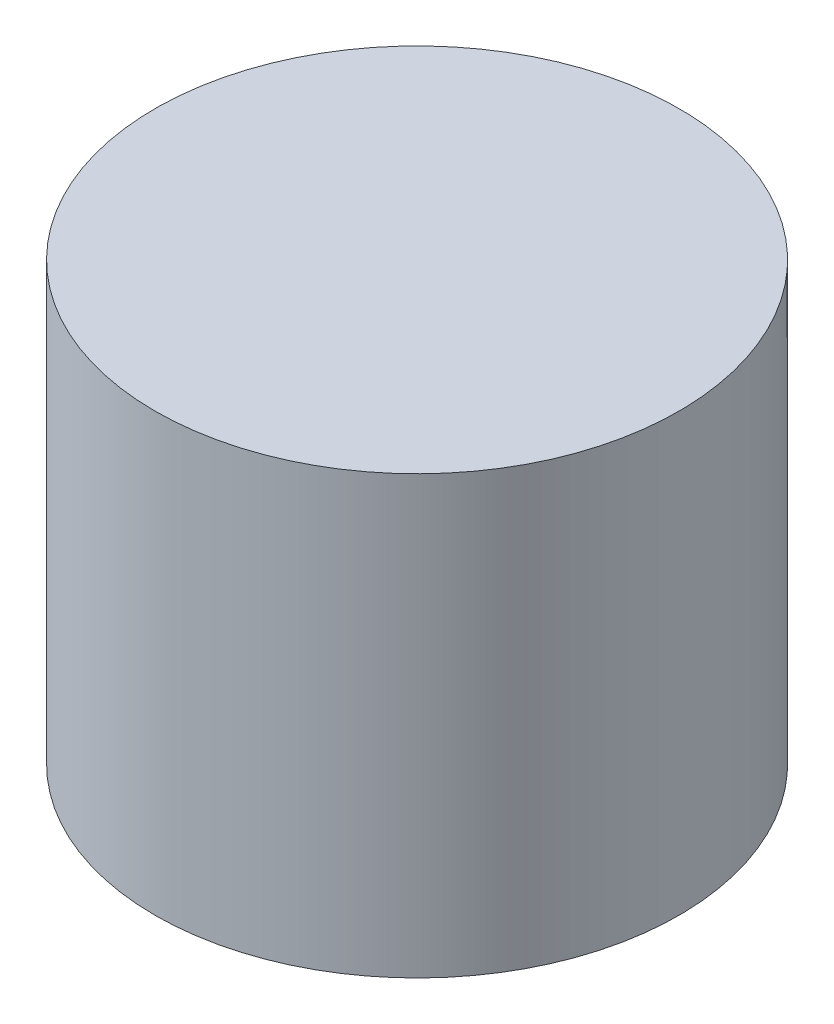
ISO-10303-21;
HEADER;
FILE_DESCRIPTION(('STEP AP214'),'2;1');
FILE_NAME('part.step','',(''),(''),'','','');
FILE_SCHEMA(('AUTOMOTIVE_DESIGN { 1 0 10303 214 1 1 1 1 }'));
ENDSEC;
DATA;
#1=APPLICATION_CONTEXT('core data for automotive mechanical design processes');
#2=APPLICATION_PROTOCOL_DEFINITION('international standard','automotive_design',2000,#1);
#3=PRODUCT_CONTEXT('',#1,'mechanical');
#4=PRODUCT('Part','Part','',(#3));
#5=PRODUCT_RELATED_PRODUCT_CATEGORY('part','',(#4));
#6=PRODUCT_DEFINITION_FORMATION('','',#4);
#7=PRODUCT_DEFINITION_CONTEXT('part definition',#1,'design');
#8=PRODUCT_DEFINITION('design','',#6,#7);
#9=PRODUCT_DEFINITION_SHAPE('','',#8);
#10=(LENGTH_UNIT() NAMED_UNIT(*) SI_UNIT(.MILLI.,.METRE.));
#11=(NAMED_UNIT(*) PLANE_ANGLE_UNIT() SI_UNIT($,.RADIAN.));
#12=(NAMED_UNIT(*) SI_UNIT($,.STERADIAN.) SOLID_ANGLE_UNIT());
#13=UNCERTAINTY_MEASURE_WITH_UNIT(LENGTH_MEASURE(1.E-05),#10,'distance_accuracy_value','');
#14=(GEOMETRIC_REPRESENTATION_CONTEXT(3) GLOBAL_UNCERTAINTY_ASSIGNED_CONTEXT((#13)) GLOBAL_UNIT_ASSIGNED_CONTEXT((#10,
#11,#12)) REPRESENTATION_CONTEXT('',''));
#15=CARTESIAN_POINT('',(0.,0.,0.));
#16=DIRECTION('',(0.,0.,1.));
#17=DIRECTION('',(1.,0.,0.));
#18=AXIS2_PLACEMENT_3D('',#15,#16,#17);
#19=CARTESIAN_POINT('',(0.,0.,0.));
#20=DIRECTION('',(0.,1.,0.));
#21=DIRECTION('',(0.,0.,1.));
#22=AXIS2_PLACEMENT_3D('',#19,#20,#21);
#23=PLANE('',#22);
#24=CARTESIAN_POINT('',(0.,0.,0.));
#25=DIRECTION('',(0.,1.,0.));
#26=DIRECTION('',(0.,0.,1.));
#27=AXIS2_PLACEMENT_3D('',#24,#25,#26);
#28=CIRCLE('',#27,12.5);
#29=CARTESIAN_POINT('',(0.,0.,12.5));
#30=VERTEX_POINT('',#29);
#31=EDGE_CURVE('E10',#30,#30,#28,.T.);
#32=ORIENTED_EDGE('',*,*,#31,.F.);
#33=EDGE_LOOP('',(#32));
#34=FACE_BOUND('',#33,.T.);
#35=ADVANCED_FACE('F31',(#34),#23,.F.);
#36=CARTESIAN_POINT('',(0.,24.9,0.));
#37=DIRECTION('',(0.,1.,0.));
#38=DIRECTION('',(0.,0.,1.));
#39=AXIS2_PLACEMENT_3D('',#36,#37,#38);
#40=CYLINDRICAL_SURFACE('',#39,12.5);
#41=CARTESIAN_POINT('',(0.,-0.0999999999999994,0.));
#42=DIRECTION('',(0.,1.,0.));
#43=DIRECTION('',(0.,0.,1.));
#44=AXIS2_PLACEMENT_3D('',#41,#42,#43);
#45=CIRCLE('',#44,12.5);
#46=CARTESIAN_POINT('',(0.,-0.0999999999999994,12.5));
#47=VERTEX_POINT('',#46);
#48=EDGE_CURVE('E37',#47,#47,#45,.T.);
#49=ORIENTED_EDGE('',*,*,#48,.F.);
#50=EDGE_LOOP('',(#49));
#51=FACE_BOUND('',#50,.T.);
#52=ORIENTED_EDGE('',*,*,#31,.T.);
#53=EDGE_LOOP('',(#52));
#54=FACE_BOUND('',#53,.T.);
#55=ADVANCED_FACE('F61',(#51,#54),#40,.F.);
#56=CARTESIAN_POINT('',(12.5,-0.0999999999999998,0.));
#57=DIRECTION('',(0.,1.,0.));
#58=DIRECTION('',(0.,0.,1.));
#59=AXIS2_PLACEMENT_3D('',#56,#57,#58);
#60=PLANE('',#59);
#61=CARTESIAN_POINT('',(0.,-0.0999999999999994,0.));
#62=DIRECTION('',(0.,1.,0.));
#63=DIRECTION('',(0.,0.,1.));
#64=AXIS2_PLACEMENT_3D('',#61,#62,#63);
#65=CIRCLE('',#64,15.);
#66=CARTESIAN_POINT('',(0.,-0.0999999999999994,15.));
#67=VERTEX_POINT('',#66);
#68=EDGE_CURVE('E41',#67,#67,#65,.T.);
#69=ORIENTED_EDGE('',*,*,#68,.F.);
#70=EDGE_LOOP('',(#69));
#71=FACE_BOUND('',#70,.T.);
#72=ORIENTED_EDGE('',*,*,#48,.T.);
#73=EDGE_LOOP('',(#72));
#74=FACE_BOUND('',#73,.T.);
#75=ADVANCED_FACE('F56',(#71,#74),#60,.F.);
#76=CARTESIAN_POINT('',(0.,24.9,0.));
#77=DIRECTION('',(0.,1.,0.));
#78=DIRECTION('',(0.,0.,1.));
#79=AXIS2_PLACEMENT_3D('',#76,#77,#78);
#80=CYLINDRICAL_SURFACE('',#79,15.);
#81=CARTESIAN_POINT('',(0.,24.9,0.));
#82=DIRECTION('',(0.,1.,0.));
#83=DIRECTION('',(0.,0.,1.));
#84=AXIS2_PLACEMENT_3D('',#81,#82,#83);
#85=CIRCLE('',#84,15.);
#86=CARTESIAN_POINT('',(0.,24.9,15.));
#87=VERTEX_POINT('',#86);
#88=EDGE_CURVE('E45',#87,#87,#85,.T.);
#89=ORIENTED_EDGE('',*,*,#88,.F.);
#90=EDGE_LOOP('',(#89));
#91=FACE_BOUND('',#90,.T.);
#92=ORIENTED_EDGE('',*,*,#68,.T.);
#93=EDGE_LOOP('',(#92));
#94=FACE_BOUND('',#93,.T.);
#95=ADVANCED_FACE('F53',(#91,#94),#80,.T.);
#96=CARTESIAN_POINT('',(15.,24.9,0.));
#97=DIRECTION('',(0.,-1.,0.));
#98=DIRECTION('',(0.,0.,-1.));
#99=AXIS2_PLACEMENT_3D('',#96,#97,#98);
#100=PLANE('',#99);
#101=ORIENTED_EDGE('',*,*,#88,.T.);
#102=EDGE_LOOP('',(#101));
#103=FACE_BOUND('',#102,.T.);
#104=ADVANCED_FACE('F51',(#103),#100,.F.);
#105=CLOSED_SHELL('',(#35,#55,#75,#95,#104));
#106=MANIFOLD_SOLID_BREP('B2',#105);
#107=ADVANCED_BREP_SHAPE_REPRESENTATION('',(#18,#106),#14);
#108=SHAPE_DEFINITION_REPRESENTATION(#9,#107);
ENDSEC;
END-ISO-10303-21;
